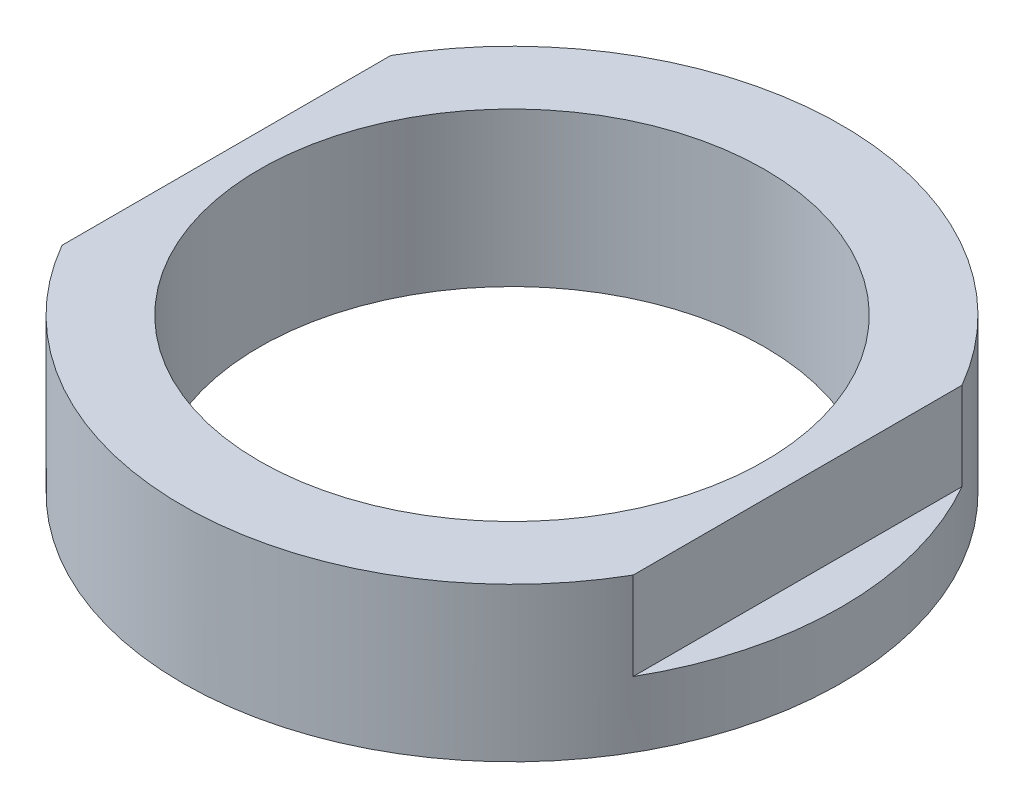
ISO-10303-21;
HEADER;
FILE_DESCRIPTION(('STEP AP214'),'2;1');
FILE_NAME('part.step','',(''),(''),'','','');
FILE_SCHEMA(('AUTOMOTIVE_DESIGN { 1 0 10303 214 1 1 1 1 }'));
ENDSEC;
DATA;
#1=APPLICATION_CONTEXT('core data for automotive mechanical design processes');
#2=APPLICATION_PROTOCOL_DEFINITION('international standard','automotive_design',2000,#1);
#3=PRODUCT_CONTEXT('',#1,'mechanical');
#4=PRODUCT('Part','Part','',(#3));
#5=PRODUCT_RELATED_PRODUCT_CATEGORY('part','',(#4));
#6=PRODUCT_DEFINITION_FORMATION('','',#4);
#7=PRODUCT_DEFINITION_CONTEXT('part definition',#1,'design');
#8=PRODUCT_DEFINITION('design','',#6,#7);
#9=PRODUCT_DEFINITION_SHAPE('','',#8);
#10=(LENGTH_UNIT() NAMED_UNIT(*) SI_UNIT(.MILLI.,.METRE.));
#11=(NAMED_UNIT(*) PLANE_ANGLE_UNIT() SI_UNIT($,.RADIAN.));
#12=(NAMED_UNIT(*) SI_UNIT($,.STERADIAN.) SOLID_ANGLE_UNIT());
#13=UNCERTAINTY_MEASURE_WITH_UNIT(LENGTH_MEASURE(1.E-05),#10,'distance_accuracy_value','');
#14=(GEOMETRIC_REPRESENTATION_CONTEXT(3) GLOBAL_UNCERTAINTY_ASSIGNED_CONTEXT((#13)) GLOBAL_UNIT_ASSIGNED_CONTEXT((#10,
#11,#12)) REPRESENTATION_CONTEXT('',''));
#15=CARTESIAN_POINT('',(0.,0.,0.));
#16=DIRECTION('',(0.,0.,1.));
#17=DIRECTION('',(1.,0.,0.));
#18=AXIS2_PLACEMENT_3D('',#15,#16,#17);
#19=CARTESIAN_POINT('',(0.,7.,0.));
#20=DIRECTION('',(0.,-1.,0.));
#21=DIRECTION('',(0.,0.,-1.));
#22=AXIS2_PLACEMENT_3D('',#19,#20,#21);
#23=CYLINDRICAL_SURFACE('',#22,15.);
#24=CARTESIAN_POINT('',(0.,7.,0.));
#25=DIRECTION('',(0.,1.,0.));
#26=DIRECTION('',(0.,0.,1.));
#27=AXIS2_PLACEMENT_3D('',#24,#25,#26);
#28=CIRCLE('',#27,15.);
#29=CARTESIAN_POINT('',(13.,7.,-7.48331477354789));
#30=VERTEX_POINT('',#29);
#31=CARTESIAN_POINT('',(-13.,7.,-7.48331477354789));
#32=VERTEX_POINT('',#31);
#33=EDGE_CURVE('E99',#30,#32,#28,.T.);
#34=ORIENTED_EDGE('',*,*,#33,.F.);
#35=DIRECTION('',(0.,-1.,0.));
#36=VECTOR('',#35,1.);
#37=CARTESIAN_POINT('',(13.,7.,-7.48331477354789));
#38=LINE('',#37,#36);
#39=CARTESIAN_POINT('',(13.,3.,-7.48331477354789));
#40=VERTEX_POINT('',#39);
#41=EDGE_CURVE('E72',#30,#40,#38,.T.);
#42=ORIENTED_EDGE('',*,*,#41,.T.);
#43=CARTESIAN_POINT('',(0.,3.,0.));
#44=DIRECTION('',(0.,1.,0.));
#45=DIRECTION('',(0.,0.,1.));
#46=AXIS2_PLACEMENT_3D('',#43,#44,#45);
#47=CIRCLE('',#46,15.);
#48=CARTESIAN_POINT('',(13.,3.,7.48331477354789));
#49=VERTEX_POINT('',#48);
#50=EDGE_CURVE('E11',#49,#40,#47,.T.);
#51=ORIENTED_EDGE('',*,*,#50,.F.);
#52=DIRECTION('',(0.,-1.,0.));
#53=VECTOR('',#52,1.);
#54=CARTESIAN_POINT('',(13.,7.,7.48331477354789));
#55=LINE('',#54,#53);
#56=CARTESIAN_POINT('',(13.,7.,7.48331477354789));
#57=VERTEX_POINT('',#56);
#58=EDGE_CURVE('E130',#49,#57,#55,.F.);
#59=ORIENTED_EDGE('',*,*,#58,.T.);
#60=CARTESIAN_POINT('',(-13.,7.,7.48331477354789));
#61=VERTEX_POINT('',#60);
#62=EDGE_CURVE('E111',#61,#57,#28,.T.);
#63=ORIENTED_EDGE('',*,*,#62,.F.);
#64=DIRECTION('',(0.,-1.,0.));
#65=VECTOR('',#64,1.);
#66=CARTESIAN_POINT('',(-13.,7.,7.48331477354789));
#67=LINE('',#66,#65);
#68=CARTESIAN_POINT('',(-13.,3.,7.48331477354789));
#69=VERTEX_POINT('',#68);
#70=EDGE_CURVE('E64',#61,#69,#67,.T.);
#71=ORIENTED_EDGE('',*,*,#70,.T.);
#72=CARTESIAN_POINT('',(0.,3.,0.));
#73=DIRECTION('',(0.,-1.,0.));
#74=DIRECTION('',(0.,0.,-1.));
#75=AXIS2_PLACEMENT_3D('',#72,#73,#74);
#76=CIRCLE('',#75,15.);
#77=CARTESIAN_POINT('',(-13.,3.,-7.48331477354789));
#78=VERTEX_POINT('',#77);
#79=EDGE_CURVE('E57',#69,#78,#76,.T.);
#80=ORIENTED_EDGE('',*,*,#79,.T.);
#81=DIRECTION('',(0.,-1.,0.));
#82=VECTOR('',#81,1.);
#83=CARTESIAN_POINT('',(-13.,7.,-7.48331477354789));
#84=LINE('',#83,#82);
#85=EDGE_CURVE('E91',#78,#32,#84,.F.);
#86=ORIENTED_EDGE('',*,*,#85,.T.);
#87=EDGE_LOOP('',(#34,#42,#51,#59,#63,#71,#80,#86));
#88=FACE_BOUND('',#87,.T.);
#89=CARTESIAN_POINT('',(0.,0.,0.));
#90=DIRECTION('',(0.,1.,0.));
#91=DIRECTION('',(0.,0.,1.));
#92=AXIS2_PLACEMENT_3D('',#89,#90,#91);
#93=CIRCLE('',#92,15.);
#94=CARTESIAN_POINT('',(0.,0.,15.));
#95=VERTEX_POINT('',#94);
#96=EDGE_CURVE('E114',#95,#95,#93,.T.);
#97=ORIENTED_EDGE('',*,*,#96,.T.);
#98=EDGE_LOOP('',(#97));
#99=FACE_BOUND('',#98,.T.);
#100=ADVANCED_FACE('F49',(#88,#99),#23,.T.);
#101=CARTESIAN_POINT('',(0.,7.,0.));
#102=DIRECTION('',(0.,1.,0.));
#103=DIRECTION('',(0.,0.,1.));
#104=AXIS2_PLACEMENT_3D('',#101,#102,#103);
#105=PLANE('',#104);
#106=DIRECTION('',(0.,0.,1.));
#107=VECTOR('',#106,1.);
#108=CARTESIAN_POINT('',(13.,7.,0.));
#109=LINE('',#108,#107);
#110=EDGE_CURVE('E98',#30,#57,#109,.T.);
#111=ORIENTED_EDGE('',*,*,#110,.F.);
#112=ORIENTED_EDGE('',*,*,#33,.T.);
#113=DIRECTION('',(0.,0.,-1.));
#114=VECTOR('',#113,1.);
#115=CARTESIAN_POINT('',(-13.,7.,0.));
#116=LINE('',#115,#114);
#117=EDGE_CURVE('E88',#61,#32,#116,.T.);
#118=ORIENTED_EDGE('',*,*,#117,.F.);
#119=ORIENTED_EDGE('',*,*,#62,.T.);
#120=EDGE_LOOP('',(#111,#112,#118,#119));
#121=FACE_BOUND('',#120,.T.);
#122=CARTESIAN_POINT('',(0.,7.,0.));
#123=DIRECTION('',(0.,1.,0.));
#124=DIRECTION('',(0.,0.,1.));
#125=AXIS2_PLACEMENT_3D('',#122,#123,#124);
#126=CIRCLE('',#125,11.5);
#127=CARTESIAN_POINT('',(0.,7.,11.5));
#128=VERTEX_POINT('',#127);
#129=EDGE_CURVE('E117',#128,#128,#126,.T.);
#130=ORIENTED_EDGE('',*,*,#129,.F.);
#131=EDGE_LOOP('',(#130));
#132=FACE_BOUND('',#131,.T.);
#133=ADVANCED_FACE('F108',(#121,#132),#105,.T.);
#134=CARTESIAN_POINT('',(0.,0.,0.));
#135=DIRECTION('',(0.,1.,0.));
#136=DIRECTION('',(0.,0.,1.));
#137=AXIS2_PLACEMENT_3D('',#134,#135,#136);
#138=PLANE('',#137);
#139=CARTESIAN_POINT('',(0.,0.,0.));
#140=DIRECTION('',(0.,1.,0.));
#141=DIRECTION('',(0.,0.,1.));
#142=AXIS2_PLACEMENT_3D('',#139,#140,#141);
#143=CIRCLE('',#142,11.5);
#144=CARTESIAN_POINT('',(0.,0.,11.5));
#145=VERTEX_POINT('',#144);
#146=EDGE_CURVE('E122',#145,#145,#143,.T.);
#147=ORIENTED_EDGE('',*,*,#146,.T.);
#148=EDGE_LOOP('',(#147));
#149=FACE_BOUND('',#148,.T.);
#150=ORIENTED_EDGE('',*,*,#96,.F.);
#151=EDGE_LOOP('',(#150));
#152=FACE_BOUND('',#151,.T.);
#153=ADVANCED_FACE('F158',(#149,#152),#138,.F.);
#154=CARTESIAN_POINT('',(0.,-11.,0.));
#155=DIRECTION('',(0.,1.,0.));
#156=DIRECTION('',(0.,0.,1.));
#157=AXIS2_PLACEMENT_3D('',#154,#155,#156);
#158=CYLINDRICAL_SURFACE('',#157,11.5);
#159=ORIENTED_EDGE('',*,*,#129,.T.);
#160=EDGE_LOOP('',(#159));
#161=FACE_BOUND('',#160,.T.);
#162=ORIENTED_EDGE('',*,*,#146,.F.);
#163=EDGE_LOOP('',(#162));
#164=FACE_BOUND('',#163,.T.);
#165=ADVANCED_FACE('F163',(#161,#164),#158,.F.);
#166=CARTESIAN_POINT('',(0.,3.,0.));
#167=DIRECTION('',(0.,-1.,0.));
#168=DIRECTION('',(0.,0.,-1.));
#169=AXIS2_PLACEMENT_3D('',#166,#167,#168);
#170=PLANE('',#169);
#171=DIRECTION('',(0.,0.,-1.));
#172=VECTOR('',#171,1.);
#173=CARTESIAN_POINT('',(-13.,3.,9.41578561460778));
#174=LINE('',#173,#172);
#175=EDGE_CURVE('E139',#69,#78,#174,.T.);
#176=ORIENTED_EDGE('',*,*,#175,.T.);
#177=ORIENTED_EDGE('',*,*,#79,.F.);
#178=EDGE_LOOP('',(#176,#177));
#179=FACE_BOUND('',#178,.T.);
#180=ADVANCED_FACE('F152',(#179),#170,.F.);
#181=CARTESIAN_POINT('',(-13.,3.,9.41578561460778));
#182=DIRECTION('',(1.,0.,0.));
#183=DIRECTION('',(0.,0.,-1.));
#184=AXIS2_PLACEMENT_3D('',#181,#182,#183);
#185=PLANE('',#184);
#186=ORIENTED_EDGE('',*,*,#117,.T.);
#187=ORIENTED_EDGE('',*,*,#85,.F.);
#188=ORIENTED_EDGE('',*,*,#175,.F.);
#189=ORIENTED_EDGE('',*,*,#70,.F.);
#190=EDGE_LOOP('',(#186,#187,#188,#189));
#191=FACE_BOUND('',#190,.T.);
#192=ADVANCED_FACE('F90',(#191),#185,.F.);
#193=CARTESIAN_POINT('',(0.,3.,0.));
#194=DIRECTION('',(0.,1.,0.));
#195=DIRECTION('',(0.,0.,1.));
#196=AXIS2_PLACEMENT_3D('',#193,#194,#195);
#197=PLANE('',#196);
#198=ORIENTED_EDGE('',*,*,#50,.T.);
#199=DIRECTION('',(0.,0.,1.));
#200=VECTOR('',#199,1.);
#201=CARTESIAN_POINT('',(13.,3.,9.41578561460778));
#202=LINE('',#201,#200);
#203=EDGE_CURVE('E106',#40,#49,#202,.T.);
#204=ORIENTED_EDGE('',*,*,#203,.T.);
#205=EDGE_LOOP('',(#198,#204));
#206=FACE_BOUND('',#205,.T.);
#207=ADVANCED_FACE('F144',(#206),#197,.T.);
#208=CARTESIAN_POINT('',(13.,3.,9.41578561460778));
#209=DIRECTION('',(-1.,0.,0.));
#210=DIRECTION('',(0.,0.,1.));
#211=AXIS2_PLACEMENT_3D('',#208,#209,#210);
#212=PLANE('',#211);
#213=ORIENTED_EDGE('',*,*,#110,.T.);
#214=ORIENTED_EDGE('',*,*,#58,.F.);
#215=ORIENTED_EDGE('',*,*,#203,.F.);
#216=ORIENTED_EDGE('',*,*,#41,.F.);
#217=EDGE_LOOP('',(#213,#214,#215,#216));
#218=FACE_BOUND('',#217,.T.);
#219=ADVANCED_FACE('F129',(#218),#212,.F.);
#220=CLOSED_SHELL('',(#100,#133,#153,#165,#180,#192,#207,#219));
#221=MANIFOLD_SOLID_BREP('B2',#220);
#222=ADVANCED_BREP_SHAPE_REPRESENTATION('',(#18,#221),#14);
#223=SHAPE_DEFINITION_REPRESENTATION(#9,#222);
ENDSEC;
END-ISO-10303-21;
